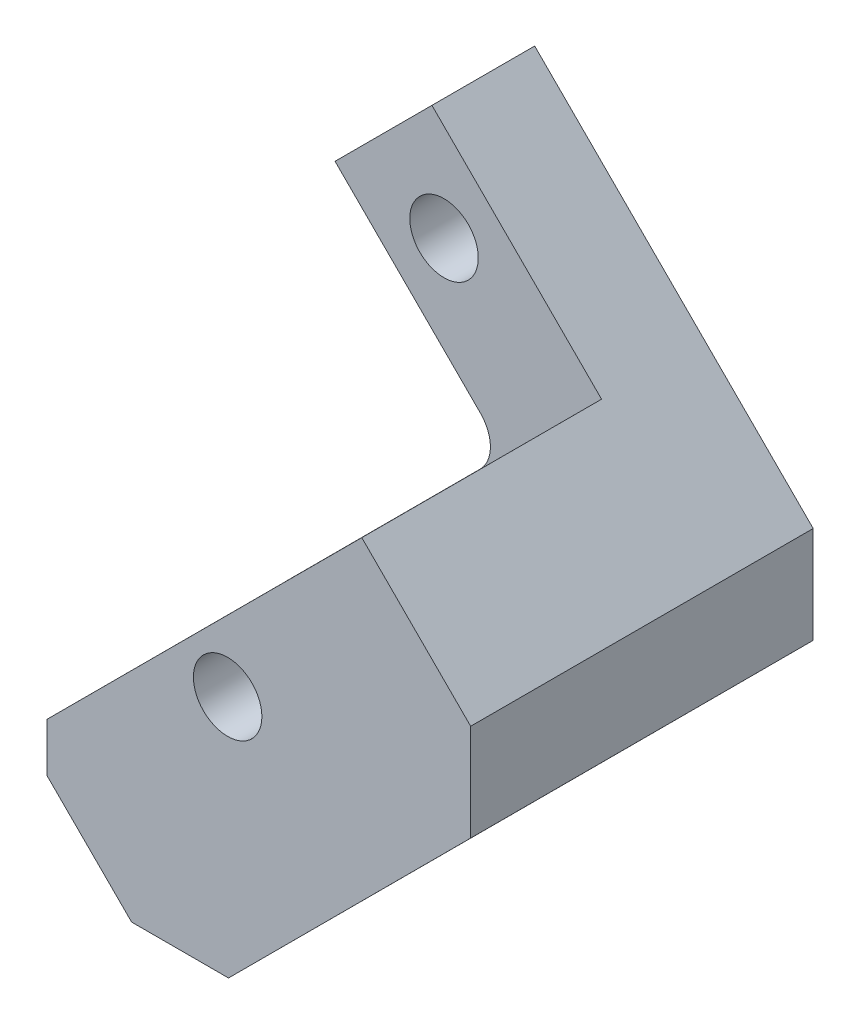
ISO-10303-21;
HEADER;
FILE_DESCRIPTION(('STEP AP214'),'2;1');
FILE_NAME('part.step','',(''),(''),'','','');
FILE_SCHEMA(('AUTOMOTIVE_DESIGN { 1 0 10303 214 1 1 1 1 }'));
ENDSEC;
DATA;
#1=APPLICATION_CONTEXT('core data for automotive mechanical design processes');
#2=APPLICATION_PROTOCOL_DEFINITION('international standard','automotive_design',2000,#1);
#3=PRODUCT_CONTEXT('',#1,'mechanical');
#4=PRODUCT('Part','Part','',(#3));
#5=PRODUCT_RELATED_PRODUCT_CATEGORY('part','',(#4));
#6=PRODUCT_DEFINITION_FORMATION('','',#4);
#7=PRODUCT_DEFINITION_CONTEXT('part definition',#1,'design');
#8=PRODUCT_DEFINITION('design','',#6,#7);
#9=PRODUCT_DEFINITION_SHAPE('','',#8);
#10=(LENGTH_UNIT() NAMED_UNIT(*) SI_UNIT(.MILLI.,.METRE.));
#11=(NAMED_UNIT(*) PLANE_ANGLE_UNIT() SI_UNIT($,.RADIAN.));
#12=(NAMED_UNIT(*) SI_UNIT($,.STERADIAN.) SOLID_ANGLE_UNIT());
#13=UNCERTAINTY_MEASURE_WITH_UNIT(LENGTH_MEASURE(1.E-05),#10,'distance_accuracy_value','');
#14=(GEOMETRIC_REPRESENTATION_CONTEXT(3) GLOBAL_UNCERTAINTY_ASSIGNED_CONTEXT((#13)) GLOBAL_UNIT_ASSIGNED_CONTEXT((#10,
#11,#12)) REPRESENTATION_CONTEXT('',''));
#15=CARTESIAN_POINT('',(0.,0.,0.));
#16=DIRECTION('',(0.,0.,1.));
#17=DIRECTION('',(1.,0.,0.));
#18=AXIS2_PLACEMENT_3D('',#15,#16,#17);
#19=CARTESIAN_POINT('',(-35.3362008856371,-178.92407937411,63.5));
#20=DIRECTION('',(0.,0.,-1.));
#21=DIRECTION('',(1.,0.,0.));
#22=AXIS2_PLACEMENT_3D('',#19,#20,#21);
#23=PLANE('',#22);
#24=CARTESIAN_POINT('',(-33.0913978447949,-145.244202713136,63.5000000000332));
#25=DIRECTION('',(0.,0.,-1.));
#26=DIRECTION('',(-1.,0.,0.));
#27=AXIS2_PLACEMENT_3D('',#24,#25,#26);
#28=CIRCLE('',#27,6.34999999999999);
#29=CARTESIAN_POINT('',(-39.4413978447949,-145.244202713136,63.5000000000332));
#30=VERTEX_POINT('',#29);
#31=EDGE_CURVE('E266',#30,#30,#28,.T.);
#32=ORIENTED_EDGE('',*,*,#31,.F.);
#33=EDGE_LOOP('',(#32));
#34=FACE_BOUND('',#33,.T.);
#35=CARTESIAN_POINT('',(-28.7572099595572,-194.485900807402,63.5));
#36=DIRECTION('',(0.,0.,1.));
#37=DIRECTION('',(1.,0.,0.));
#38=AXIS2_PLACEMENT_3D('',#35,#36,#37);
#39=CIRCLE('',#38,6.35000000000007);
#40=CARTESIAN_POINT('',(-22.4072099595572,-194.485900807402,63.5));
#41=VERTEX_POINT('',#40);
#42=EDGE_CURVE('E240',#41,#41,#39,.T.);
#43=ORIENTED_EDGE('',*,*,#42,.T.);
#44=EDGE_LOOP('',(#43));
#45=FACE_BOUND('',#44,.T.);
#46=DIRECTION('',(-0.707024560680282,-0.707188992133542,0.));
#47=VECTOR('',#46,1.);
#48=CARTESIAN_POINT('',(-30.8455507855891,-183.41368533443,63.5));
#49=LINE('',#48,#47);
#50=CARTESIAN_POINT('',(-26.3559447038807,-178.923035112965,63.5));
#51=VERTEX_POINT('',#50);
#52=CARTESIAN_POINT('',(-62.2811453828484,-214.8565908524,63.5));
#53=VERTEX_POINT('',#52);
#54=EDGE_CURVE('E164',#51,#53,#49,.T.);
#55=ORIENTED_EDGE('',*,*,#54,.F.);
#56=CARTESIAN_POINT('',(-30.8465948039287,-174.433429152645,63.5));
#57=DIRECTION('',(0.,0.,-1.));
#58=DIRECTION('',(-1.,0.,0.));
#59=AXIS2_PLACEMENT_3D('',#56,#57,#58);
#60=CIRCLE('',#59,6.35);
#61=CARTESIAN_POINT('',(-26.3559447038841,-169.943823192322,63.5));
#62=VERTEX_POINT('',#61);
#63=EDGE_CURVE('E13',#51,#62,#60,.F.);
#64=ORIENTED_EDGE('',*,*,#63,.T.);
#65=DIRECTION('',(-0.707024560680824,0.707188992133,0.));
#66=VECTOR('',#65,1.);
#67=CARTESIAN_POINT('',(-26.354900685548,-169.944867453464,63.5));
#68=LINE('',#67,#66);
#69=CARTESIAN_POINT('',(-53.2946252124914,-142.998877602412,63.5));
#70=VERTEX_POINT('',#69);
#71=EDGE_CURVE('E220',#62,#70,#68,.T.);
#72=ORIENTED_EDGE('',*,*,#71,.T.);
#73=DIRECTION('',(-0.707024560680281,-0.707188992133542,0.));
#74=VECTOR('',#73,1.);
#75=CARTESIAN_POINT('',(-35.3362008856578,-125.036276716552,63.5));
#76=LINE('',#75,#74);
#77=CARTESIAN_POINT('',(-35.3362008856578,-125.036276716552,63.5));
#78=VERTEX_POINT('',#77);
#79=EDGE_CURVE('E189',#78,#70,#76,.T.);
#80=ORIENTED_EDGE('',*,*,#79,.F.);
#81=DIRECTION('',(-0.707024560680825,0.707188992132999,0.));
#82=VECTOR('',#81,1.);
#83=CARTESIAN_POINT('',(16.2942692968059,-176.678754506192,63.5));
#84=LINE('',#83,#82);
#85=CARTESIAN_POINT('',(16.2942692968059,-176.678754506192,63.5));
#86=VERTEX_POINT('',#85);
#87=EDGE_CURVE('E186',#86,#78,#84,.T.);
#88=ORIENTED_EDGE('',*,*,#87,.F.);
#89=DIRECTION('',(-3.85137845750008E-13,1.,0.));
#90=VECTOR('',#89,1.);
#91=CARTESIAN_POINT('',(16.2942692968128,-194.641354906377,63.5));
#92=LINE('',#91,#90);
#93=CARTESIAN_POINT('',(16.2942692968128,-194.641354906377,63.5));
#94=VERTEX_POINT('',#93);
#95=EDGE_CURVE('E183',#94,#86,#92,.T.);
#96=ORIENTED_EDGE('',*,*,#95,.F.);
#97=DIRECTION('',(0.707024560680284,0.707188992133539,0.));
#98=VECTOR('',#97,1.);
#99=CARTESIAN_POINT('',(-28.5955276530321,-239.54159179701,63.5));
#100=LINE('',#99,#98);
#101=CARTESIAN_POINT('',(-28.5955276530321,-239.54159179701,63.5));
#102=VERTEX_POINT('',#101);
#103=EDGE_CURVE('E180',#102,#94,#100,.T.);
#104=ORIENTED_EDGE('',*,*,#103,.F.);
#105=DIRECTION('',(0.999999972962297,0.000232541189325037,0.));
#106=VECTOR('',#105,1.);
#107=CARTESIAN_POINT('',(-46.5581275675497,-239.54576884147,63.5));
#108=LINE('',#107,#106);
#109=CARTESIAN_POINT('',(-46.5581275675497,-239.54576884147,63.5));
#110=VERTEX_POINT('',#109);
#111=EDGE_CURVE('E177',#110,#102,#108,.T.);
#112=ORIENTED_EDGE('',*,*,#111,.F.);
#113=DIRECTION('',(0.707353385344728,-0.706860090994924,0.));
#114=VECTOR('',#113,1.);
#115=CARTESIAN_POINT('',(-62.2790573462291,-223.835802530266,63.5));
#116=LINE('',#115,#114);
#117=CARTESIAN_POINT('',(-62.2790573462291,-223.835802530266,63.5));
#118=VERTEX_POINT('',#117);
#119=EDGE_CURVE('E174',#118,#110,#116,.T.);
#120=ORIENTED_EDGE('',*,*,#119,.F.);
#121=DIRECTION('',(0.000232541189329441,-0.999999972962297,0.));
#122=VECTOR('',#121,1.);
#123=CARTESIAN_POINT('',(-62.2811453828484,-214.8565908524,63.5));
#124=LINE('',#123,#122);
#125=EDGE_CURVE('E166',#53,#118,#124,.T.);
#126=ORIENTED_EDGE('',*,*,#125,.F.);
#127=EDGE_LOOP('',(#55,#64,#72,#80,#88,#96,#104,#112,#120,#126));
#128=FACE_BOUND('',#127,.T.);
#129=ADVANCED_FACE('F46',(#34,#45,#128),#23,.T.);
#130=CARTESIAN_POINT('',(-35.3362008856578,-125.036276716552,63.5));
#131=DIRECTION('',(0.707188992133542,-0.707024560680281,0.));
#132=DIRECTION('',(0.707024560680282,0.707188992133542,0.));
#133=AXIS2_PLACEMENT_3D('',#130,#131,#132);
#134=PLANE('',#133);
#135=DIRECTION('',(0.,0.,1.));
#136=VECTOR('',#135,1.);
#137=CARTESIAN_POINT('',(-53.2946252124914,-142.998877602412,-127.381055809253));
#138=LINE('',#137,#136);
#139=CARTESIAN_POINT('',(-53.2946252124914,-142.998877602412,82.55));
#140=VERTEX_POINT('',#139);
#141=EDGE_CURVE('E262',#70,#140,#138,.T.);
#142=ORIENTED_EDGE('',*,*,#141,.T.);
#143=DIRECTION('',(-0.707024560680282,-0.707188992133542,0.));
#144=VECTOR('',#143,1.);
#145=CARTESIAN_POINT('',(-35.3362008856578,-125.036276716552,82.55));
#146=LINE('',#145,#144);
#147=CARTESIAN_POINT('',(-35.3362008856578,-125.036276716552,82.55));
#148=VERTEX_POINT('',#147);
#149=EDGE_CURVE('E225',#148,#140,#146,.T.);
#150=ORIENTED_EDGE('',*,*,#149,.F.);
#151=DIRECTION('',(0.,0.,1.));
#152=VECTOR('',#151,1.);
#153=CARTESIAN_POINT('',(-35.3362008856578,-125.036276716552,63.5));
#154=LINE('',#153,#152);
#155=EDGE_CURVE('E192',#78,#148,#154,.T.);
#156=ORIENTED_EDGE('',*,*,#155,.F.);
#157=ORIENTED_EDGE('',*,*,#79,.T.);
#158=EDGE_LOOP('',(#142,#150,#156,#157));
#159=FACE_BOUND('',#158,.T.);
#160=ADVANCED_FACE('F261',(#159),#134,.F.);
#161=CARTESIAN_POINT('',(18.564129990977,-134.042640883238,82.55));
#162=DIRECTION('',(0.,0.,-1.));
#163=DIRECTION('',(1.,0.,0.));
#164=AXIS2_PLACEMENT_3D('',#161,#162,#163);
#165=PLANE('',#164);
#166=CARTESIAN_POINT('',(-33.0913978447949,-145.244202713136,82.55));
#167=DIRECTION('',(0.,0.,-1.));
#168=DIRECTION('',(-1.,0.,0.));
#169=AXIS2_PLACEMENT_3D('',#166,#167,#168);
#170=CIRCLE('',#169,6.34999999999999);
#171=CARTESIAN_POINT('',(-39.4413978447949,-145.244202713136,82.55));
#172=VERTEX_POINT('',#171);
#173=EDGE_CURVE('E50',#172,#172,#170,.T.);
#174=ORIENTED_EDGE('',*,*,#173,.T.);
#175=EDGE_LOOP('',(#174));
#176=FACE_BOUND('',#175,.T.);
#177=DIRECTION('',(-0.707024560680824,0.707188992133,0.));
#178=VECTOR('',#177,1.);
#179=CARTESIAN_POINT('',(-21.8517209094241,-174.449094526147,82.55));
#180=LINE('',#179,#178);
#181=CARTESIAN_POINT('',(-26.3559447038841,-169.943823192322,82.55));
#182=VERTEX_POINT('',#181);
#183=EDGE_CURVE('E145',#182,#140,#180,.T.);
#184=ORIENTED_EDGE('',*,*,#183,.F.);
#185=CARTESIAN_POINT('',(-30.8465948039287,-174.433429152645,82.55));
#186=DIRECTION('',(0.,0.,-1.));
#187=DIRECTION('',(-1.,0.,0.));
#188=AXIS2_PLACEMENT_3D('',#185,#186,#187);
#189=CIRCLE('',#188,6.35);
#190=CARTESIAN_POINT('',(-26.3559447038807,-178.923035112965,82.55));
#191=VERTEX_POINT('',#190);
#192=EDGE_CURVE('E55',#182,#191,#189,.T.);
#193=ORIENTED_EDGE('',*,*,#192,.T.);
#194=DIRECTION('',(-0.707024560680282,-0.707188992133542,0.));
#195=VECTOR('',#194,1.);
#196=CARTESIAN_POINT('',(-30.8455507855891,-183.41368533443,82.55));
#197=LINE('',#196,#195);
#198=CARTESIAN_POINT('',(-62.2811453828484,-214.8565908524,82.55));
#199=VERTEX_POINT('',#198);
#200=EDGE_CURVE('E228',#191,#199,#197,.T.);
#201=ORIENTED_EDGE('',*,*,#200,.T.);
#202=DIRECTION('',(0.000232541189329441,-0.999999972962297,0.));
#203=VECTOR('',#202,1.);
#204=CARTESIAN_POINT('',(-62.2811453828484,-214.8565908524,82.55));
#205=LINE('',#204,#203);
#206=CARTESIAN_POINT('',(-62.2811424703114,-214.869115674172,82.55));
#207=VERTEX_POINT('',#206);
#208=EDGE_CURVE('E233',#199,#207,#205,.T.);
#209=ORIENTED_EDGE('',*,*,#208,.T.);
#210=DIRECTION('',(-0.707188992132999,-0.707024560680825,0.));
#211=VECTOR('',#210,1.);
#212=CARTESIAN_POINT('',(18.564129990977,-134.042640883238,82.55));
#213=LINE('',#212,#211);
#214=CARTESIAN_POINT('',(-3.88912050924579,-156.490670684854,82.55));
#215=VERTEX_POINT('',#214);
#216=EDGE_CURVE('E156',#215,#207,#213,.T.);
#217=ORIENTED_EDGE('',*,*,#216,.F.);
#218=DIRECTION('',(-0.707024560680825,0.707188992132999,0.));
#219=VECTOR('',#218,1.);
#220=CARTESIAN_POINT('',(-35.3362008856578,-125.036276716552,82.55));
#221=LINE('',#220,#219);
#222=EDGE_CURVE('E143',#215,#148,#221,.T.);
#223=ORIENTED_EDGE('',*,*,#222,.T.);
#224=ORIENTED_EDGE('',*,*,#149,.T.);
#225=EDGE_LOOP('',(#184,#193,#201,#209,#217,#223,#224));
#226=FACE_BOUND('',#225,.T.);
#227=ADVANCED_FACE('F224',(#176,#226),#165,.F.);
#228=CARTESIAN_POINT('',(-35.3362008856371,-178.92407937411,127.));
#229=DIRECTION('',(0.,0.,-1.));
#230=DIRECTION('',(1.,0.,0.));
#231=AXIS2_PLACEMENT_3D('',#228,#229,#230);
#232=PLANE('',#231);
#233=DIRECTION('',(0.000232541189329441,-0.999999972962297,0.));
#234=VECTOR('',#233,1.);
#235=CARTESIAN_POINT('',(-62.2811453828484,-214.8565908524,127.));
#236=LINE('',#235,#234);
#237=CARTESIAN_POINT('',(-62.2811424703114,-214.869115674172,127.));
#238=VERTEX_POINT('',#237);
#239=CARTESIAN_POINT('',(-62.2790573462291,-223.835802530266,127.));
#240=VERTEX_POINT('',#239);
#241=EDGE_CURVE('E243',#238,#240,#236,.T.);
#242=ORIENTED_EDGE('',*,*,#241,.T.);
#243=DIRECTION('',(0.707353385344728,-0.706860090994924,0.));
#244=VECTOR('',#243,1.);
#245=CARTESIAN_POINT('',(-62.2790573462291,-223.835802530266,127.));
#246=LINE('',#245,#244);
#247=CARTESIAN_POINT('',(-46.5581275675497,-239.54576884147,127.));
#248=VERTEX_POINT('',#247);
#249=EDGE_CURVE('E245',#240,#248,#246,.T.);
#250=ORIENTED_EDGE('',*,*,#249,.T.);
#251=DIRECTION('',(0.999999972962297,0.000232541189325037,0.));
#252=VECTOR('',#251,1.);
#253=CARTESIAN_POINT('',(-46.5581275675497,-239.54576884147,127.));
#254=LINE('',#253,#252);
#255=CARTESIAN_POINT('',(-28.5955276530321,-239.54159179701,127.));
#256=VERTEX_POINT('',#255);
#257=EDGE_CURVE('E248',#248,#256,#254,.T.);
#258=ORIENTED_EDGE('',*,*,#257,.T.);
#259=DIRECTION('',(0.707024560680284,0.707188992133539,0.));
#260=VECTOR('',#259,1.);
#261=CARTESIAN_POINT('',(-28.5955276530321,-239.54159179701,127.));
#262=LINE('',#261,#260);
#263=CARTESIAN_POINT('',(16.2942692968128,-194.641354906377,127.));
#264=VERTEX_POINT('',#263);
#265=EDGE_CURVE('E168',#256,#264,#262,.T.);
#266=ORIENTED_EDGE('',*,*,#265,.T.);
#267=DIRECTION('',(-3.85137845750008E-13,1.,0.));
#268=VECTOR('',#267,1.);
#269=CARTESIAN_POINT('',(16.2942692968128,-194.641354906377,127.));
#270=LINE('',#269,#268);
#271=CARTESIAN_POINT('',(16.2942692968059,-176.678754506192,127.));
#272=VERTEX_POINT('',#271);
#273=EDGE_CURVE('E163',#264,#272,#270,.T.);
#274=ORIENTED_EDGE('',*,*,#273,.T.);
#275=DIRECTION('',(-0.707024560680824,0.707188992132999,0.));
#276=VECTOR('',#275,1.);
#277=CARTESIAN_POINT('',(-35.3362008856578,-125.036276716552,127.));
#278=LINE('',#277,#276);
#279=CARTESIAN_POINT('',(-3.88912050924579,-156.490670684854,127.));
#280=VERTEX_POINT('',#279);
#281=EDGE_CURVE('E139',#272,#280,#278,.T.);
#282=ORIENTED_EDGE('',*,*,#281,.T.);
#283=DIRECTION('',(-0.707188992132999,-0.707024560680825,0.));
#284=VECTOR('',#283,1.);
#285=CARTESIAN_POINT('',(18.564129990977,-134.042640883238,127.));
#286=LINE('',#285,#284);
#287=EDGE_CURVE('E149',#280,#238,#286,.T.);
#288=ORIENTED_EDGE('',*,*,#287,.T.);
#289=EDGE_LOOP('',(#242,#250,#258,#266,#274,#282,#288));
#290=FACE_BOUND('',#289,.T.);
#291=CARTESIAN_POINT('',(-28.7572099595572,-194.485900807402,127.));
#292=DIRECTION('',(0.,0.,1.));
#293=DIRECTION('',(1.,0.,0.));
#294=AXIS2_PLACEMENT_3D('',#291,#292,#293);
#295=CIRCLE('',#294,6.35000000000007);
#296=CARTESIAN_POINT('',(-22.4072099595572,-194.485900807402,127.));
#297=VERTEX_POINT('',#296);
#298=EDGE_CURVE('E237',#297,#297,#295,.T.);
#299=ORIENTED_EDGE('',*,*,#298,.F.);
#300=EDGE_LOOP('',(#299));
#301=FACE_BOUND('',#300,.T.);
#302=ADVANCED_FACE('F159',(#290,#301),#232,.F.);
#303=CARTESIAN_POINT('',(-30.8455507855891,-183.41368533443,63.5));
#304=DIRECTION('',(0.707188992133542,-0.707024560680282,0.));
#305=DIRECTION('',(0.707024560680282,0.707188992133542,0.));
#306=AXIS2_PLACEMENT_3D('',#303,#304,#305);
#307=PLANE('',#306);
#308=ORIENTED_EDGE('',*,*,#200,.F.);
#309=DIRECTION('',(0.,0.,1.));
#310=VECTOR('',#309,1.);
#311=CARTESIAN_POINT('',(-26.3559447038807,-178.923035112965,63.5));
#312=LINE('',#311,#310);
#313=EDGE_CURVE('E62',#191,#51,#312,.F.);
#314=ORIENTED_EDGE('',*,*,#313,.T.);
#315=ORIENTED_EDGE('',*,*,#54,.T.);
#316=DIRECTION('',(0.,0.,1.));
#317=VECTOR('',#316,1.);
#318=CARTESIAN_POINT('',(-62.2811453828484,-214.8565908524,63.5));
#319=LINE('',#318,#317);
#320=EDGE_CURVE('E146',#53,#199,#319,.T.);
#321=ORIENTED_EDGE('',*,*,#320,.T.);
#322=EDGE_LOOP('',(#308,#314,#315,#321));
#323=FACE_BOUND('',#322,.T.);
#324=ADVANCED_FACE('F48',(#323),#307,.F.);
#325=CARTESIAN_POINT('',(-62.2811453828484,-214.8565908524,63.5));
#326=DIRECTION('',(0.999999972962297,0.000232541189329441,0.));
#327=DIRECTION('',(-0.000232541189329441,0.999999972962297,0.));
#328=AXIS2_PLACEMENT_3D('',#325,#326,#327);
#329=PLANE('',#328);
#330=ORIENTED_EDGE('',*,*,#320,.F.);
#331=ORIENTED_EDGE('',*,*,#125,.T.);
#332=DIRECTION('',(0.,0.,1.));
#333=VECTOR('',#332,1.);
#334=CARTESIAN_POINT('',(-62.2790573462291,-223.835802530266,63.5));
#335=LINE('',#334,#333);
#336=EDGE_CURVE('E202',#118,#240,#335,.T.);
#337=ORIENTED_EDGE('',*,*,#336,.T.);
#338=ORIENTED_EDGE('',*,*,#241,.F.);
#339=DIRECTION('',(0.,0.,1.));
#340=VECTOR('',#339,1.);
#341=CARTESIAN_POINT('',(-62.2811424703114,-214.869115674172,63.5));
#342=LINE('',#341,#340);
#343=EDGE_CURVE('E152',#207,#238,#342,.T.);
#344=ORIENTED_EDGE('',*,*,#343,.F.);
#345=ORIENTED_EDGE('',*,*,#208,.F.);
#346=EDGE_LOOP('',(#330,#331,#337,#338,#344,#345));
#347=FACE_BOUND('',#346,.T.);
#348=ADVANCED_FACE('F383',(#347),#329,.F.);
#349=CARTESIAN_POINT('',(-62.2790573462291,-223.835802530266,63.5));
#350=DIRECTION('',(0.706860090994924,0.707353385344728,0.));
#351=DIRECTION('',(-0.707353385344728,0.706860090994924,0.));
#352=AXIS2_PLACEMENT_3D('',#349,#350,#351);
#353=PLANE('',#352);
#354=ORIENTED_EDGE('',*,*,#249,.F.);
#355=ORIENTED_EDGE('',*,*,#336,.F.);
#356=ORIENTED_EDGE('',*,*,#119,.T.);
#357=DIRECTION('',(0.,0.,1.));
#358=VECTOR('',#357,1.);
#359=CARTESIAN_POINT('',(-46.5581275675497,-239.54576884147,63.5));
#360=LINE('',#359,#358);
#361=EDGE_CURVE('E200',#110,#248,#360,.T.);
#362=ORIENTED_EDGE('',*,*,#361,.T.);
#363=EDGE_LOOP('',(#354,#355,#356,#362));
#364=FACE_BOUND('',#363,.T.);
#365=ADVANCED_FACE('F283',(#364),#353,.F.);
#366=CARTESIAN_POINT('',(-46.5581275675497,-239.54576884147,63.5));
#367=DIRECTION('',(-0.000232541189325037,0.999999972962297,0.));
#368=DIRECTION('',(-0.999999972962297,-0.000232541189325037,0.));
#369=AXIS2_PLACEMENT_3D('',#366,#367,#368);
#370=PLANE('',#369);
#371=ORIENTED_EDGE('',*,*,#257,.F.);
#372=ORIENTED_EDGE('',*,*,#361,.F.);
#373=ORIENTED_EDGE('',*,*,#111,.T.);
#374=DIRECTION('',(0.,0.,1.));
#375=VECTOR('',#374,1.);
#376=CARTESIAN_POINT('',(-28.5955276530321,-239.54159179701,63.5));
#377=LINE('',#376,#375);
#378=EDGE_CURVE('E198',#102,#256,#377,.T.);
#379=ORIENTED_EDGE('',*,*,#378,.T.);
#380=EDGE_LOOP('',(#371,#372,#373,#379));
#381=FACE_BOUND('',#380,.T.);
#382=ADVANCED_FACE('F276',(#381),#370,.F.);
#383=CARTESIAN_POINT('',(-28.5955276530321,-239.54159179701,63.5));
#384=DIRECTION('',(-0.707188992133539,0.707024560680284,0.));
#385=DIRECTION('',(-0.707024560680284,-0.70718899213354,0.));
#386=AXIS2_PLACEMENT_3D('',#383,#384,#385);
#387=PLANE('',#386);
#388=CARTESIAN_POINT('',(-19.6184037690083,-230.562380119141,101.6));
#389=DIRECTION('',(0.707188992133539,-0.707024560680284,0.));
#390=DIRECTION('',(0.707024560680284,0.707188992133539,0.));
#391=AXIS2_PLACEMENT_3D('',#388,#389,#390);
#392=CIRCLE('',#391,6.35);
#393=CARTESIAN_POINT('',(-15.1287978086885,-226.071730019093,101.6));
#394=VERTEX_POINT('',#393);
#395=EDGE_CURVE('E208',#394,#394,#392,.T.);
#396=ORIENTED_EDGE('',*,*,#395,.F.);
#397=EDGE_LOOP('',(#396));
#398=FACE_BOUND('',#397,.T.);
#399=ORIENTED_EDGE('',*,*,#265,.F.);
#400=ORIENTED_EDGE('',*,*,#378,.F.);
#401=ORIENTED_EDGE('',*,*,#103,.T.);
#402=DIRECTION('',(0.,0.,1.));
#403=VECTOR('',#402,1.);
#404=CARTESIAN_POINT('',(16.2942692968128,-194.641354906377,63.5));
#405=LINE('',#404,#403);
#406=EDGE_CURVE('E196',#94,#264,#405,.T.);
#407=ORIENTED_EDGE('',*,*,#406,.T.);
#408=EDGE_LOOP('',(#399,#400,#401,#407));
#409=FACE_BOUND('',#408,.T.);
#410=ADVANCED_FACE('F253',(#398,#409),#387,.F.);
#411=CARTESIAN_POINT('',(16.2942692968128,-194.641354906377,63.5));
#412=DIRECTION('',(-1.,-3.85137845750008E-13,0.));
#413=DIRECTION('',(3.85137845750008E-13,-1.,0.));
#414=AXIS2_PLACEMENT_3D('',#411,#412,#413);
#415=PLANE('',#414);
#416=ORIENTED_EDGE('',*,*,#273,.F.);
#417=ORIENTED_EDGE('',*,*,#406,.F.);
#418=ORIENTED_EDGE('',*,*,#95,.T.);
#419=DIRECTION('',(0.,0.,1.));
#420=VECTOR('',#419,1.);
#421=CARTESIAN_POINT('',(16.2942692968059,-176.678754506192,63.5));
#422=LINE('',#421,#420);
#423=EDGE_CURVE('E194',#86,#272,#422,.T.);
#424=ORIENTED_EDGE('',*,*,#423,.T.);
#425=EDGE_LOOP('',(#416,#417,#418,#424));
#426=FACE_BOUND('',#425,.T.);
#427=ADVANCED_FACE('F257',(#426),#415,.F.);
#428=CARTESIAN_POINT('',(-35.3362008856578,-125.036276716552,63.5));
#429=DIRECTION('',(-0.707188992132999,-0.707024560680825,0.));
#430=DIRECTION('',(0.707024560680825,-0.707188992132999,0.));
#431=AXIS2_PLACEMENT_3D('',#428,#429,#430);
#432=PLANE('',#431);
#433=DIRECTION('',(0.,0.,-1.));
#434=VECTOR('',#433,1.);
#435=CARTESIAN_POINT('',(-3.88912050924579,-156.490670684854,63.5));
#436=LINE('',#435,#434);
#437=EDGE_CURVE('E135',#280,#215,#436,.T.);
#438=ORIENTED_EDGE('',*,*,#437,.F.);
#439=ORIENTED_EDGE('',*,*,#281,.F.);
#440=ORIENTED_EDGE('',*,*,#423,.F.);
#441=ORIENTED_EDGE('',*,*,#87,.T.);
#442=ORIENTED_EDGE('',*,*,#155,.T.);
#443=ORIENTED_EDGE('',*,*,#222,.F.);
#444=EDGE_LOOP('',(#438,#439,#440,#441,#442,#443));
#445=FACE_BOUND('',#444,.T.);
#446=ADVANCED_FACE('F137',(#445),#432,.F.);
#447=CARTESIAN_POINT('',(-28.7572099595572,-194.485900807402,63.5));
#448=DIRECTION('',(0.,0.,1.));
#449=DIRECTION('',(-1.,0.,0.));
#450=AXIS2_PLACEMENT_3D('',#447,#448,#449);
#451=CYLINDRICAL_SURFACE('',#450,6.35000000000007);
#452=ORIENTED_EDGE('',*,*,#42,.F.);
#453=EDGE_LOOP('',(#452));
#454=FACE_BOUND('',#453,.T.);
#455=ORIENTED_EDGE('',*,*,#298,.T.);
#456=EDGE_LOOP('',(#455));
#457=FACE_BOUND('',#456,.T.);
#458=ADVANCED_FACE('F299',(#454,#457),#451,.F.);
#459=CARTESIAN_POINT('',(18.564129990977,-134.042640883238,127.));
#460=DIRECTION('',(0.707024560680825,-0.707188992132999,0.));
#461=DIRECTION('',(0.707188992132999,0.707024560680825,0.));
#462=AXIS2_PLACEMENT_3D('',#459,#460,#461);
#463=PLANE('',#462);
#464=CARTESIAN_POINT('',(-48.7982302195508,-201.389338391384,101.6));
#465=DIRECTION('',(0.707024560680825,-0.707188992132999,0.));
#466=DIRECTION('',(0.707188992132999,0.707024560680825,0.));
#467=AXIS2_PLACEMENT_3D('',#464,#465,#466);
#468=ELLIPSE('',#467,6.3500001716894,6.34999999999998);
#469=CARTESIAN_POINT('',(-44.3075799980894,-196.899732309672,101.6));
#470=VERTEX_POINT('',#469);
#471=EDGE_CURVE('E157',#470,#470,#468,.T.);
#472=ORIENTED_EDGE('',*,*,#471,.T.);
#473=EDGE_LOOP('',(#472));
#474=FACE_BOUND('',#473,.T.);
#475=ORIENTED_EDGE('',*,*,#216,.T.);
#476=ORIENTED_EDGE('',*,*,#343,.T.);
#477=ORIENTED_EDGE('',*,*,#287,.F.);
#478=ORIENTED_EDGE('',*,*,#437,.T.);
#479=EDGE_LOOP('',(#475,#476,#477,#478));
#480=FACE_BOUND('',#479,.T.);
#481=ADVANCED_FACE('F150',(#474,#480),#463,.F.);
#482=CARTESIAN_POINT('',(-19.6184037690083,-230.562380119141,101.6));
#483=DIRECTION('',(0.707188992133539,-0.707024560680284,0.));
#484=DIRECTION('',(0.707024560680284,0.707188992133539,0.));
#485=AXIS2_PLACEMENT_3D('',#482,#483,#484);
#486=CYLINDRICAL_SURFACE('',#485,6.34999999999998);
#487=ORIENTED_EDGE('',*,*,#395,.T.);
#488=EDGE_LOOP('',(#487));
#489=FACE_BOUND('',#488,.T.);
#490=ORIENTED_EDGE('',*,*,#471,.F.);
#491=EDGE_LOOP('',(#490));
#492=FACE_BOUND('',#491,.T.);
#493=ADVANCED_FACE('F272',(#489,#492),#486,.F.);
#494=CARTESIAN_POINT('',(-53.2946252124914,-142.998877602412,-127.381055809253));
#495=DIRECTION('',(-0.707188992133,-0.707024560680823,0.));
#496=DIRECTION('',(0.707024560680824,-0.707188992133,0.));
#497=AXIS2_PLACEMENT_3D('',#494,#495,#496);
#498=PLANE('',#497);
#499=ORIENTED_EDGE('',*,*,#71,.F.);
#500=DIRECTION('',(0.,0.,1.));
#501=VECTOR('',#500,1.);
#502=CARTESIAN_POINT('',(-26.3559447038841,-169.943823192322,-127.381055809253));
#503=LINE('',#502,#501);
#504=EDGE_CURVE('E210',#62,#182,#503,.T.);
#505=ORIENTED_EDGE('',*,*,#504,.T.);
#506=ORIENTED_EDGE('',*,*,#183,.T.);
#507=ORIENTED_EDGE('',*,*,#141,.F.);
#508=EDGE_LOOP('',(#499,#505,#506,#507));
#509=FACE_BOUND('',#508,.T.);
#510=ADVANCED_FACE('F217',(#509),#498,.T.);
#511=CARTESIAN_POINT('',(-30.8465948039287,-174.433429152645,-127.381055809253));
#512=DIRECTION('',(0.,0.,1.));
#513=DIRECTION('',(1.,0.,0.));
#514=AXIS2_PLACEMENT_3D('',#511,#512,#513);
#515=CYLINDRICAL_SURFACE('',#514,6.35);
#516=ORIENTED_EDGE('',*,*,#63,.F.);
#517=ORIENTED_EDGE('',*,*,#313,.F.);
#518=ORIENTED_EDGE('',*,*,#192,.F.);
#519=ORIENTED_EDGE('',*,*,#504,.F.);
#520=EDGE_LOOP('',(#516,#517,#518,#519));
#521=FACE_BOUND('',#520,.T.);
#522=ADVANCED_FACE('F319',(#521),#515,.F.);
#523=CARTESIAN_POINT('',(-33.0913978447949,-145.244202713136,63.5000000000332));
#524=DIRECTION('',(0.,0.,-1.));
#525=DIRECTION('',(-1.,0.,0.));
#526=AXIS2_PLACEMENT_3D('',#523,#524,#525);
#527=CYLINDRICAL_SURFACE('',#526,6.34999999999999);
#528=ORIENTED_EDGE('',*,*,#31,.T.);
#529=EDGE_LOOP('',(#528));
#530=FACE_BOUND('',#529,.T.);
#531=ORIENTED_EDGE('',*,*,#173,.F.);
#532=EDGE_LOOP('',(#531));
#533=FACE_BOUND('',#532,.T.);
#534=ADVANCED_FACE('F322',(#530,#533),#527,.F.);
#535=CLOSED_SHELL('',(#129,#160,#227,#302,#324,#348,#365,#382,#410,#427,#446,#458,#481,#493,
#510,#522,#534));
#536=MANIFOLD_SOLID_BREP('B2',#535);
#537=ADVANCED_BREP_SHAPE_REPRESENTATION('',(#18,#536),#14);
#538=SHAPE_DEFINITION_REPRESENTATION(#9,#537);
ENDSEC;
END-ISO-10303-21;
